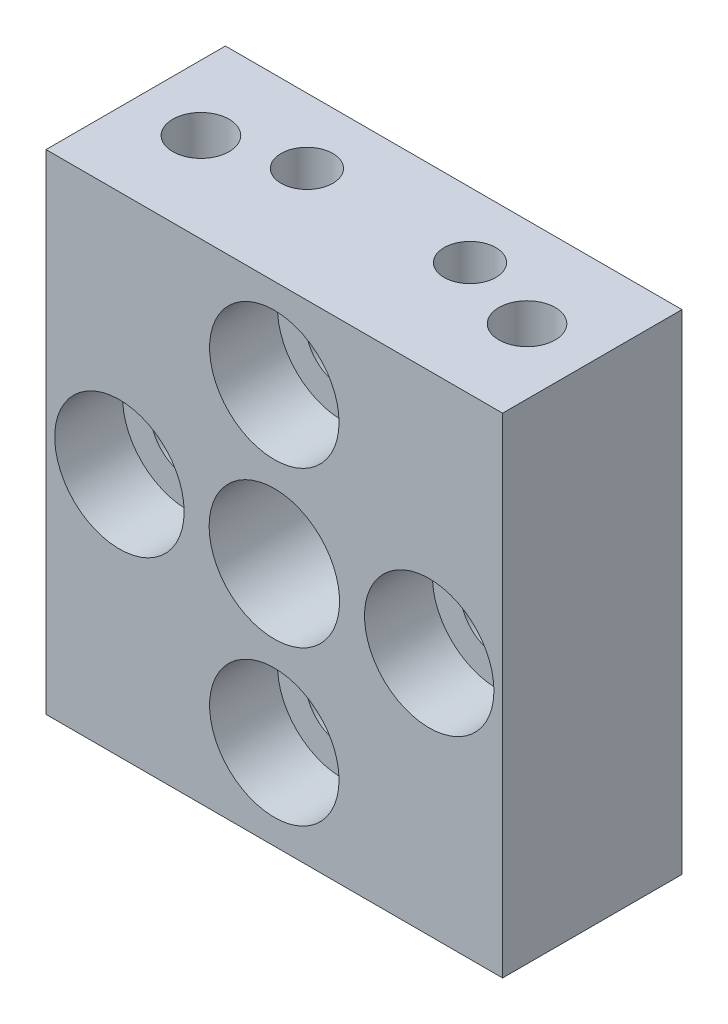
ISO-10303-21;
HEADER;
FILE_DESCRIPTION(('STEP AP214'),'2;1');
FILE_NAME('part.step','',(''),(''),'','','');
FILE_SCHEMA(('AUTOMOTIVE_DESIGN { 1 0 10303 214 1 1 1 1 }'));
ENDSEC;
DATA;
#1=APPLICATION_CONTEXT('core data for automotive mechanical design processes');
#2=APPLICATION_PROTOCOL_DEFINITION('international standard','automotive_design',2000,#1);
#3=PRODUCT_CONTEXT('',#1,'mechanical');
#4=PRODUCT('Part','Part','',(#3));
#5=PRODUCT_RELATED_PRODUCT_CATEGORY('part','',(#4));
#6=PRODUCT_DEFINITION_FORMATION('','',#4);
#7=PRODUCT_DEFINITION_CONTEXT('part definition',#1,'design');
#8=PRODUCT_DEFINITION('design','',#6,#7);
#9=PRODUCT_DEFINITION_SHAPE('','',#8);
#10=(LENGTH_UNIT() NAMED_UNIT(*) SI_UNIT(.MILLI.,.METRE.));
#11=(NAMED_UNIT(*) PLANE_ANGLE_UNIT() SI_UNIT($,.RADIAN.));
#12=(NAMED_UNIT(*) SI_UNIT($,.STERADIAN.) SOLID_ANGLE_UNIT());
#13=UNCERTAINTY_MEASURE_WITH_UNIT(LENGTH_MEASURE(1.E-05),#10,'distance_accuracy_value','');
#14=(GEOMETRIC_REPRESENTATION_CONTEXT(3) GLOBAL_UNCERTAINTY_ASSIGNED_CONTEXT((#13)) GLOBAL_UNIT_ASSIGNED_CONTEXT((#10,
#11,#12)) REPRESENTATION_CONTEXT('',''));
#15=CARTESIAN_POINT('',(0.,0.,0.));
#16=DIRECTION('',(0.,0.,1.));
#17=DIRECTION('',(1.,0.,0.));
#18=AXIS2_PLACEMENT_3D('',#15,#16,#17);
#19=CARTESIAN_POINT('',(0.,-15.,11.));
#20=DIRECTION('',(1.,0.,0.));
#21=DIRECTION('',(0.,0.,-1.));
#22=AXIS2_PLACEMENT_3D('',#19,#20,#21);
#23=PLANE('',#22);
#24=DIRECTION('',(0.,-1.,0.));
#25=VECTOR('',#24,1.);
#26=CARTESIAN_POINT('',(0.,-15.,0.));
#27=LINE('',#26,#25);
#28=CARTESIAN_POINT('',(0.,15.,0.));
#29=VERTEX_POINT('',#28);
#30=CARTESIAN_POINT('',(0.,-15.,0.));
#31=VERTEX_POINT('',#30);
#32=EDGE_CURVE('E231',#29,#31,#27,.T.);
#33=ORIENTED_EDGE('',*,*,#32,.T.);
#34=DIRECTION('',(0.,0.,-1.));
#35=VECTOR('',#34,1.);
#36=CARTESIAN_POINT('',(0.,-15.,11.));
#37=LINE('',#36,#35);
#38=CARTESIAN_POINT('',(0.,-15.,11.));
#39=VERTEX_POINT('',#38);
#40=EDGE_CURVE('E11',#39,#31,#37,.T.);
#41=ORIENTED_EDGE('',*,*,#40,.F.);
#42=DIRECTION('',(0.,-1.,0.));
#43=VECTOR('',#42,1.);
#44=CARTESIAN_POINT('',(0.,-15.,11.));
#45=LINE('',#44,#43);
#46=CARTESIAN_POINT('',(0.,15.,11.));
#47=VERTEX_POINT('',#46);
#48=EDGE_CURVE('E232',#47,#39,#45,.T.);
#49=ORIENTED_EDGE('',*,*,#48,.F.);
#50=DIRECTION('',(0.,0.,-1.));
#51=VECTOR('',#50,1.);
#52=CARTESIAN_POINT('',(0.,15.,11.));
#53=LINE('',#52,#51);
#54=EDGE_CURVE('E238',#47,#29,#53,.T.);
#55=ORIENTED_EDGE('',*,*,#54,.T.);
#56=EDGE_LOOP('',(#33,#41,#49,#55));
#57=FACE_BOUND('',#56,.T.);
#58=ADVANCED_FACE('F36',(#57),#23,.F.);
#59=CARTESIAN_POINT('',(0.,-15.,11.));
#60=DIRECTION('',(0.,1.,0.));
#61=DIRECTION('',(0.,0.,1.));
#62=AXIS2_PLACEMENT_3D('',#59,#60,#61);
#63=PLANE('',#62);
#64=CARTESIAN_POINT('',(9.,-15.,4.));
#65=DIRECTION('',(0.,-1.,0.));
#66=DIRECTION('',(0.,0.,-1.));
#67=AXIS2_PLACEMENT_3D('',#64,#65,#66);
#68=CIRCLE('',#67,1.5875);
#69=CARTESIAN_POINT('',(9.,-15.,2.4125));
#70=VERTEX_POINT('',#69);
#71=EDGE_CURVE('E119',#70,#70,#68,.T.);
#72=ORIENTED_EDGE('',*,*,#71,.F.);
#73=EDGE_LOOP('',(#72));
#74=FACE_BOUND('',#73,.T.);
#75=CARTESIAN_POINT('',(19.,-15.,4.));
#76=DIRECTION('',(0.,-1.,0.));
#77=DIRECTION('',(0.,0.,-1.));
#78=AXIS2_PLACEMENT_3D('',#75,#76,#77);
#79=CIRCLE('',#78,1.5875);
#80=CARTESIAN_POINT('',(19.,-15.,2.4125));
#81=VERTEX_POINT('',#80);
#82=EDGE_CURVE('E118',#81,#81,#79,.T.);
#83=ORIENTED_EDGE('',*,*,#82,.F.);
#84=EDGE_LOOP('',(#83));
#85=FACE_BOUND('',#84,.T.);
#86=CARTESIAN_POINT('',(4.,-15.,5.5));
#87=DIRECTION('',(0.,-1.,0.));
#88=DIRECTION('',(0.,0.,-1.));
#89=AXIS2_PLACEMENT_3D('',#86,#87,#88);
#90=CIRCLE('',#89,1.7272);
#91=CARTESIAN_POINT('',(4.,-15.,3.7728));
#92=VERTEX_POINT('',#91);
#93=EDGE_CURVE('E129',#92,#92,#90,.T.);
#94=ORIENTED_EDGE('',*,*,#93,.F.);
#95=EDGE_LOOP('',(#94));
#96=FACE_BOUND('',#95,.T.);
#97=CARTESIAN_POINT('',(24.,-15.,5.5));
#98=DIRECTION('',(0.,-1.,0.));
#99=DIRECTION('',(0.,0.,-1.));
#100=AXIS2_PLACEMENT_3D('',#97,#98,#99);
#101=CIRCLE('',#100,1.7272);
#102=CARTESIAN_POINT('',(24.,-15.,3.7728));
#103=VERTEX_POINT('',#102);
#104=EDGE_CURVE('E135',#103,#103,#101,.T.);
#105=ORIENTED_EDGE('',*,*,#104,.F.);
#106=EDGE_LOOP('',(#105));
#107=FACE_BOUND('',#106,.T.);
#108=DIRECTION('',(1.,0.,0.));
#109=VECTOR('',#108,1.);
#110=CARTESIAN_POINT('',(0.,-15.,0.));
#111=LINE('',#110,#109);
#112=CARTESIAN_POINT('',(28.,-15.,0.));
#113=VERTEX_POINT('',#112);
#114=EDGE_CURVE('E241',#31,#113,#111,.T.);
#115=ORIENTED_EDGE('',*,*,#114,.T.);
#116=DIRECTION('',(0.,0.,-1.));
#117=VECTOR('',#116,1.);
#118=CARTESIAN_POINT('',(28.,-15.,11.));
#119=LINE('',#118,#117);
#120=CARTESIAN_POINT('',(28.,-15.,11.));
#121=VERTEX_POINT('',#120);
#122=EDGE_CURVE('E44',#121,#113,#119,.T.);
#123=ORIENTED_EDGE('',*,*,#122,.F.);
#124=DIRECTION('',(1.,0.,0.));
#125=VECTOR('',#124,1.);
#126=CARTESIAN_POINT('',(0.,-15.,11.));
#127=LINE('',#126,#125);
#128=EDGE_CURVE('E83',#39,#121,#127,.T.);
#129=ORIENTED_EDGE('',*,*,#128,.F.);
#130=ORIENTED_EDGE('',*,*,#40,.T.);
#131=EDGE_LOOP('',(#115,#123,#129,#130));
#132=FACE_BOUND('',#131,.T.);
#133=ADVANCED_FACE('F266',(#74,#85,#96,#107,#132),#63,.F.);
#134=CARTESIAN_POINT('',(28.,-15.,11.));
#135=DIRECTION('',(-1.,0.,0.));
#136=DIRECTION('',(0.,0.,1.));
#137=AXIS2_PLACEMENT_3D('',#134,#135,#136);
#138=PLANE('',#137);
#139=DIRECTION('',(0.,1.,0.));
#140=VECTOR('',#139,1.);
#141=CARTESIAN_POINT('',(28.,-15.,0.));
#142=LINE('',#141,#140);
#143=CARTESIAN_POINT('',(28.,15.,0.));
#144=VERTEX_POINT('',#143);
#145=EDGE_CURVE('E70',#113,#144,#142,.T.);
#146=ORIENTED_EDGE('',*,*,#145,.T.);
#147=DIRECTION('',(0.,0.,-1.));
#148=VECTOR('',#147,1.);
#149=CARTESIAN_POINT('',(28.,15.,11.));
#150=LINE('',#149,#148);
#151=CARTESIAN_POINT('',(28.,15.,11.));
#152=VERTEX_POINT('',#151);
#153=EDGE_CURVE('E246',#152,#144,#150,.T.);
#154=ORIENTED_EDGE('',*,*,#153,.F.);
#155=DIRECTION('',(0.,1.,0.));
#156=VECTOR('',#155,1.);
#157=CARTESIAN_POINT('',(28.,-15.,11.));
#158=LINE('',#157,#156);
#159=EDGE_CURVE('E235',#121,#152,#158,.T.);
#160=ORIENTED_EDGE('',*,*,#159,.F.);
#161=ORIENTED_EDGE('',*,*,#122,.T.);
#162=EDGE_LOOP('',(#146,#154,#160,#161));
#163=FACE_BOUND('',#162,.T.);
#164=ADVANCED_FACE('F248',(#163),#138,.F.);
#165=CARTESIAN_POINT('',(0.,15.,11.));
#166=DIRECTION('',(0.,-1.,0.));
#167=DIRECTION('',(0.,0.,-1.));
#168=AXIS2_PLACEMENT_3D('',#165,#166,#167);
#169=PLANE('',#168);
#170=CARTESIAN_POINT('',(9.,15.,4.));
#171=DIRECTION('',(0.,1.,0.));
#172=DIRECTION('',(0.,0.,1.));
#173=AXIS2_PLACEMENT_3D('',#170,#171,#172);
#174=CIRCLE('',#173,1.5875);
#175=CARTESIAN_POINT('',(9.,15.,5.5875));
#176=VERTEX_POINT('',#175);
#177=EDGE_CURVE('E141',#176,#176,#174,.T.);
#178=ORIENTED_EDGE('',*,*,#177,.F.);
#179=EDGE_LOOP('',(#178));
#180=FACE_BOUND('',#179,.T.);
#181=CARTESIAN_POINT('',(19.,15.,4.));
#182=DIRECTION('',(0.,1.,0.));
#183=DIRECTION('',(0.,0.,1.));
#184=AXIS2_PLACEMENT_3D('',#181,#182,#183);
#185=CIRCLE('',#184,1.5875);
#186=CARTESIAN_POINT('',(19.,15.,5.5875));
#187=VERTEX_POINT('',#186);
#188=EDGE_CURVE('E147',#187,#187,#185,.T.);
#189=ORIENTED_EDGE('',*,*,#188,.F.);
#190=EDGE_LOOP('',(#189));
#191=FACE_BOUND('',#190,.T.);
#192=CARTESIAN_POINT('',(4.,15.,5.5));
#193=DIRECTION('',(0.,1.,0.));
#194=DIRECTION('',(0.,0.,1.));
#195=AXIS2_PLACEMENT_3D('',#192,#193,#194);
#196=CIRCLE('',#195,1.7272);
#197=CARTESIAN_POINT('',(4.,15.,7.2272));
#198=VERTEX_POINT('',#197);
#199=EDGE_CURVE('E153',#198,#198,#196,.T.);
#200=ORIENTED_EDGE('',*,*,#199,.F.);
#201=EDGE_LOOP('',(#200));
#202=FACE_BOUND('',#201,.T.);
#203=CARTESIAN_POINT('',(24.,15.,5.5));
#204=DIRECTION('',(0.,1.,0.));
#205=DIRECTION('',(0.,0.,1.));
#206=AXIS2_PLACEMENT_3D('',#203,#204,#205);
#207=CIRCLE('',#206,1.7272);
#208=CARTESIAN_POINT('',(24.,15.,7.2272));
#209=VERTEX_POINT('',#208);
#210=EDGE_CURVE('E159',#209,#209,#207,.T.);
#211=ORIENTED_EDGE('',*,*,#210,.F.);
#212=EDGE_LOOP('',(#211));
#213=FACE_BOUND('',#212,.T.);
#214=DIRECTION('',(-1.,0.,0.));
#215=VECTOR('',#214,1.);
#216=CARTESIAN_POINT('',(0.,15.,0.));
#217=LINE('',#216,#215);
#218=EDGE_CURVE('E76',#144,#29,#217,.T.);
#219=ORIENTED_EDGE('',*,*,#218,.T.);
#220=ORIENTED_EDGE('',*,*,#54,.F.);
#221=DIRECTION('',(-1.,0.,0.));
#222=VECTOR('',#221,1.);
#223=CARTESIAN_POINT('',(0.,15.,11.));
#224=LINE('',#223,#222);
#225=EDGE_CURVE('E52',#152,#47,#224,.T.);
#226=ORIENTED_EDGE('',*,*,#225,.F.);
#227=ORIENTED_EDGE('',*,*,#153,.T.);
#228=EDGE_LOOP('',(#219,#220,#226,#227));
#229=FACE_BOUND('',#228,.T.);
#230=ADVANCED_FACE('F255',(#180,#191,#202,#213,#229),#169,.F.);
#231=CARTESIAN_POINT('',(0.,0.,11.));
#232=DIRECTION('',(0.,0.,-1.));
#233=DIRECTION('',(-1.,0.,0.));
#234=AXIS2_PLACEMENT_3D('',#231,#232,#233);
#235=PLANE('',#234);
#236=CARTESIAN_POINT('',(4.5,0.,11.));
#237=DIRECTION('',(0.,0.,1.));
#238=DIRECTION('',(1.,0.,0.));
#239=AXIS2_PLACEMENT_3D('',#236,#237,#238);
#240=CIRCLE('',#239,3.96875);
#241=CARTESIAN_POINT('',(8.46875,0.,11.));
#242=VERTEX_POINT('',#241);
#243=EDGE_CURVE('E165',#242,#242,#240,.T.);
#244=ORIENTED_EDGE('',*,*,#243,.F.);
#245=EDGE_LOOP('',(#244));
#246=FACE_BOUND('',#245,.T.);
#247=CARTESIAN_POINT('',(14.,9.5,11.));
#248=DIRECTION('',(0.,0.,1.));
#249=DIRECTION('',(1.,0.,0.));
#250=AXIS2_PLACEMENT_3D('',#247,#248,#249);
#251=CIRCLE('',#250,3.96875);
#252=CARTESIAN_POINT('',(17.96875,9.5,11.));
#253=VERTEX_POINT('',#252);
#254=EDGE_CURVE('E177',#253,#253,#251,.T.);
#255=ORIENTED_EDGE('',*,*,#254,.F.);
#256=EDGE_LOOP('',(#255));
#257=FACE_BOUND('',#256,.T.);
#258=CARTESIAN_POINT('',(14.,-9.5,11.));
#259=DIRECTION('',(0.,0.,1.));
#260=DIRECTION('',(1.,0.,0.));
#261=AXIS2_PLACEMENT_3D('',#258,#259,#260);
#262=CIRCLE('',#261,3.96875);
#263=CARTESIAN_POINT('',(17.96875,-9.5,11.));
#264=VERTEX_POINT('',#263);
#265=EDGE_CURVE('E189',#264,#264,#262,.T.);
#266=ORIENTED_EDGE('',*,*,#265,.F.);
#267=EDGE_LOOP('',(#266));
#268=FACE_BOUND('',#267,.T.);
#269=CARTESIAN_POINT('',(23.5,0.,11.));
#270=DIRECTION('',(0.,0.,1.));
#271=DIRECTION('',(1.,0.,0.));
#272=AXIS2_PLACEMENT_3D('',#269,#270,#271);
#273=CIRCLE('',#272,3.96875);
#274=CARTESIAN_POINT('',(27.46875,0.,11.));
#275=VERTEX_POINT('',#274);
#276=EDGE_CURVE('E201',#275,#275,#273,.T.);
#277=ORIENTED_EDGE('',*,*,#276,.F.);
#278=EDGE_LOOP('',(#277));
#279=FACE_BOUND('',#278,.T.);
#280=CARTESIAN_POINT('',(14.,0.,11.));
#281=DIRECTION('',(0.,0.,-1.));
#282=DIRECTION('',(-1.,0.,0.));
#283=AXIS2_PLACEMENT_3D('',#280,#281,#282);
#284=CIRCLE('',#283,4.);
#285=CARTESIAN_POINT('',(10.,0.,11.));
#286=VERTEX_POINT('',#285);
#287=EDGE_CURVE('E228',#286,#286,#284,.T.);
#288=ORIENTED_EDGE('',*,*,#287,.T.);
#289=EDGE_LOOP('',(#288));
#290=FACE_BOUND('',#289,.T.);
#291=ORIENTED_EDGE('',*,*,#48,.T.);
#292=ORIENTED_EDGE('',*,*,#128,.T.);
#293=ORIENTED_EDGE('',*,*,#159,.T.);
#294=ORIENTED_EDGE('',*,*,#225,.T.);
#295=EDGE_LOOP('',(#291,#292,#293,#294));
#296=FACE_BOUND('',#295,.T.);
#297=ADVANCED_FACE('F257',(#246,#257,#268,#279,#290,#296),#235,.F.);
#298=CARTESIAN_POINT('',(0.,0.,0.));
#299=DIRECTION('',(0.,0.,-1.));
#300=DIRECTION('',(-1.,0.,0.));
#301=AXIS2_PLACEMENT_3D('',#298,#299,#300);
#302=PLANE('',#301);
#303=CARTESIAN_POINT('',(4.5,0.,0.));
#304=DIRECTION('',(0.,0.,-1.));
#305=DIRECTION('',(-1.,0.,0.));
#306=AXIS2_PLACEMENT_3D('',#303,#304,#305);
#307=CIRCLE('',#306,2.2479);
#308=CARTESIAN_POINT('',(2.2521,0.,0.));
#309=VERTEX_POINT('',#308);
#310=EDGE_CURVE('E174',#309,#309,#307,.T.);
#311=ORIENTED_EDGE('',*,*,#310,.F.);
#312=EDGE_LOOP('',(#311));
#313=FACE_BOUND('',#312,.T.);
#314=CARTESIAN_POINT('',(14.,9.5,0.));
#315=DIRECTION('',(0.,0.,-1.));
#316=DIRECTION('',(-1.,0.,0.));
#317=AXIS2_PLACEMENT_3D('',#314,#315,#316);
#318=CIRCLE('',#317,2.2479);
#319=CARTESIAN_POINT('',(11.7521,9.5,0.));
#320=VERTEX_POINT('',#319);
#321=EDGE_CURVE('E186',#320,#320,#318,.T.);
#322=ORIENTED_EDGE('',*,*,#321,.F.);
#323=EDGE_LOOP('',(#322));
#324=FACE_BOUND('',#323,.T.);
#325=CARTESIAN_POINT('',(14.,-9.5,0.));
#326=DIRECTION('',(0.,0.,-1.));
#327=DIRECTION('',(-1.,0.,0.));
#328=AXIS2_PLACEMENT_3D('',#325,#326,#327);
#329=CIRCLE('',#328,2.2479);
#330=CARTESIAN_POINT('',(11.7521,-9.5,0.));
#331=VERTEX_POINT('',#330);
#332=EDGE_CURVE('E198',#331,#331,#329,.T.);
#333=ORIENTED_EDGE('',*,*,#332,.F.);
#334=EDGE_LOOP('',(#333));
#335=FACE_BOUND('',#334,.T.);
#336=CARTESIAN_POINT('',(23.5,0.,0.));
#337=DIRECTION('',(0.,0.,-1.));
#338=DIRECTION('',(-1.,0.,0.));
#339=AXIS2_PLACEMENT_3D('',#336,#337,#338);
#340=CIRCLE('',#339,2.2479);
#341=CARTESIAN_POINT('',(21.2521,0.,0.));
#342=VERTEX_POINT('',#341);
#343=EDGE_CURVE('E210',#342,#342,#340,.T.);
#344=ORIENTED_EDGE('',*,*,#343,.F.);
#345=EDGE_LOOP('',(#344));
#346=FACE_BOUND('',#345,.T.);
#347=CARTESIAN_POINT('',(14.,0.,0.));
#348=DIRECTION('',(0.,0.,-1.));
#349=DIRECTION('',(-1.,0.,0.));
#350=AXIS2_PLACEMENT_3D('',#347,#348,#349);
#351=CIRCLE('',#350,6.5);
#352=CARTESIAN_POINT('',(7.5,0.,0.));
#353=VERTEX_POINT('',#352);
#354=EDGE_CURVE('E213',#353,#353,#351,.T.);
#355=ORIENTED_EDGE('',*,*,#354,.F.);
#356=EDGE_LOOP('',(#355));
#357=FACE_BOUND('',#356,.T.);
#358=ORIENTED_EDGE('',*,*,#32,.F.);
#359=ORIENTED_EDGE('',*,*,#218,.F.);
#360=ORIENTED_EDGE('',*,*,#145,.F.);
#361=ORIENTED_EDGE('',*,*,#114,.F.);
#362=EDGE_LOOP('',(#358,#359,#360,#361));
#363=FACE_BOUND('',#362,.T.);
#364=ADVANCED_FACE('F251',(#313,#324,#335,#346,#357,#363),#302,.T.);
#365=CARTESIAN_POINT('',(14.,0.,0.));
#366=DIRECTION('',(0.,0.,-1.));
#367=DIRECTION('',(-1.,0.,0.));
#368=AXIS2_PLACEMENT_3D('',#365,#366,#367);
#369=CYLINDRICAL_SURFACE('',#368,4.);
#370=ORIENTED_EDGE('',*,*,#287,.F.);
#371=EDGE_LOOP('',(#370));
#372=FACE_BOUND('',#371,.T.);
#373=CARTESIAN_POINT('',(14.,0.,3.25000000000001));
#374=DIRECTION('',(0.,0.,-1.));
#375=DIRECTION('',(-1.,0.,0.));
#376=AXIS2_PLACEMENT_3D('',#373,#374,#375);
#377=CIRCLE('',#376,4.);
#378=CARTESIAN_POINT('',(10.,0.,3.25000000000001));
#379=VERTEX_POINT('',#378);
#380=EDGE_CURVE('E225',#379,#379,#377,.T.);
#381=ORIENTED_EDGE('',*,*,#380,.T.);
#382=EDGE_LOOP('',(#381));
#383=FACE_BOUND('',#382,.T.);
#384=ADVANCED_FACE('F399',(#372,#383),#369,.F.);
#385=CARTESIAN_POINT('',(14.,0.,3.));
#386=DIRECTION('',(0.,0.,-1.));
#387=DIRECTION('',(-1.,0.,0.));
#388=AXIS2_PLACEMENT_3D('',#385,#386,#387);
#389=CONICAL_SURFACE('',#388,4.25,0.785398163397436);
#390=ORIENTED_EDGE('',*,*,#380,.F.);
#391=EDGE_LOOP('',(#390));
#392=FACE_BOUND('',#391,.T.);
#393=CARTESIAN_POINT('',(14.,0.,3.));
#394=DIRECTION('',(0.,0.,-1.));
#395=DIRECTION('',(-1.,0.,0.));
#396=AXIS2_PLACEMENT_3D('',#393,#394,#395);
#397=CIRCLE('',#396,4.25);
#398=CARTESIAN_POINT('',(9.75,0.,3.));
#399=VERTEX_POINT('',#398);
#400=EDGE_CURVE('E222',#399,#399,#397,.T.);
#401=ORIENTED_EDGE('',*,*,#400,.T.);
#402=EDGE_LOOP('',(#401));
#403=FACE_BOUND('',#402,.T.);
#404=ADVANCED_FACE('F395',(#392,#403),#389,.F.);
#405=CARTESIAN_POINT('',(18.25,0.,3.));
#406=DIRECTION('',(0.,0.,1.));
#407=DIRECTION('',(1.,0.,0.));
#408=AXIS2_PLACEMENT_3D('',#405,#406,#407);
#409=PLANE('',#408);
#410=ORIENTED_EDGE('',*,*,#400,.F.);
#411=EDGE_LOOP('',(#410));
#412=FACE_BOUND('',#411,.T.);
#413=CARTESIAN_POINT('',(14.,0.,3.));
#414=DIRECTION('',(0.,0.,-1.));
#415=DIRECTION('',(-1.,0.,0.));
#416=AXIS2_PLACEMENT_3D('',#413,#414,#415);
#417=CIRCLE('',#416,5.49999999999999);
#418=CARTESIAN_POINT('',(8.50000000000001,0.,3.));
#419=VERTEX_POINT('',#418);
#420=EDGE_CURVE('E219',#419,#419,#417,.T.);
#421=ORIENTED_EDGE('',*,*,#420,.T.);
#422=EDGE_LOOP('',(#421));
#423=FACE_BOUND('',#422,.T.);
#424=ADVANCED_FACE('F391',(#412,#423),#409,.F.);
#425=CARTESIAN_POINT('',(14.,0.,0.));
#426=DIRECTION('',(0.,0.,-1.));
#427=DIRECTION('',(-1.,0.,0.));
#428=AXIS2_PLACEMENT_3D('',#425,#426,#427);
#429=CYLINDRICAL_SURFACE('',#428,5.5);
#430=ORIENTED_EDGE('',*,*,#420,.F.);
#431=EDGE_LOOP('',(#430));
#432=FACE_BOUND('',#431,.T.);
#433=CARTESIAN_POINT('',(14.,0.,1.));
#434=DIRECTION('',(0.,0.,-1.));
#435=DIRECTION('',(-1.,0.,0.));
#436=AXIS2_PLACEMENT_3D('',#433,#434,#435);
#437=CIRCLE('',#436,5.5);
#438=CARTESIAN_POINT('',(8.5,0.,1.));
#439=VERTEX_POINT('',#438);
#440=EDGE_CURVE('E216',#439,#439,#437,.T.);
#441=ORIENTED_EDGE('',*,*,#440,.T.);
#442=EDGE_LOOP('',(#441));
#443=FACE_BOUND('',#442,.T.);
#444=ADVANCED_FACE('F387',(#432,#443),#429,.F.);
#445=CARTESIAN_POINT('',(14.,0.,0.));
#446=DIRECTION('',(0.,0.,-1.));
#447=DIRECTION('',(-1.,0.,0.));
#448=AXIS2_PLACEMENT_3D('',#445,#446,#447);
#449=CONICAL_SURFACE('',#448,6.5,0.785398163397449);
#450=ORIENTED_EDGE('',*,*,#440,.F.);
#451=EDGE_LOOP('',(#450));
#452=FACE_BOUND('',#451,.T.);
#453=ORIENTED_EDGE('',*,*,#354,.T.);
#454=EDGE_LOOP('',(#453));
#455=FACE_BOUND('',#454,.T.);
#456=ADVANCED_FACE('F383',(#452,#455),#449,.F.);
#457=CARTESIAN_POINT('',(23.5,0.,11.));
#458=DIRECTION('',(0.,0.,1.));
#459=DIRECTION('',(1.,0.,0.));
#460=AXIS2_PLACEMENT_3D('',#457,#458,#459);
#461=CYLINDRICAL_SURFACE('',#460,2.2479);
#462=CARTESIAN_POINT('',(23.5,0.,6.8344));
#463=DIRECTION('',(0.,0.,1.));
#464=DIRECTION('',(1.,0.,0.));
#465=AXIS2_PLACEMENT_3D('',#462,#463,#464);
#466=CIRCLE('',#465,2.2479);
#467=CARTESIAN_POINT('',(25.7479,0.,6.8344));
#468=VERTEX_POINT('',#467);
#469=EDGE_CURVE('E207',#468,#468,#466,.T.);
#470=ORIENTED_EDGE('',*,*,#469,.T.);
#471=EDGE_LOOP('',(#470));
#472=FACE_BOUND('',#471,.T.);
#473=ORIENTED_EDGE('',*,*,#343,.T.);
#474=EDGE_LOOP('',(#473));
#475=FACE_BOUND('',#474,.T.);
#476=ADVANCED_FACE('F379',(#472,#475),#461,.F.);
#477=CARTESIAN_POINT('',(25.7479,0.,6.8344));
#478=DIRECTION('',(0.,0.,-1.));
#479=DIRECTION('',(-1.,0.,0.));
#480=AXIS2_PLACEMENT_3D('',#477,#478,#479);
#481=PLANE('',#480);
#482=ORIENTED_EDGE('',*,*,#469,.F.);
#483=EDGE_LOOP('',(#482));
#484=FACE_BOUND('',#483,.T.);
#485=CARTESIAN_POINT('',(23.5,0.,6.8344));
#486=DIRECTION('',(0.,0.,1.));
#487=DIRECTION('',(1.,0.,0.));
#488=AXIS2_PLACEMENT_3D('',#485,#486,#487);
#489=CIRCLE('',#488,3.96875);
#490=CARTESIAN_POINT('',(27.46875,0.,6.8344));
#491=VERTEX_POINT('',#490);
#492=EDGE_CURVE('E204',#491,#491,#489,.T.);
#493=ORIENTED_EDGE('',*,*,#492,.T.);
#494=EDGE_LOOP('',(#493));
#495=FACE_BOUND('',#494,.T.);
#496=ADVANCED_FACE('F375',(#484,#495),#481,.F.);
#497=CARTESIAN_POINT('',(23.5,0.,11.));
#498=DIRECTION('',(0.,0.,1.));
#499=DIRECTION('',(1.,0.,0.));
#500=AXIS2_PLACEMENT_3D('',#497,#498,#499);
#501=CYLINDRICAL_SURFACE('',#500,3.96875);
#502=ORIENTED_EDGE('',*,*,#492,.F.);
#503=EDGE_LOOP('',(#502));
#504=FACE_BOUND('',#503,.T.);
#505=ORIENTED_EDGE('',*,*,#276,.T.);
#506=EDGE_LOOP('',(#505));
#507=FACE_BOUND('',#506,.T.);
#508=ADVANCED_FACE('F371',(#504,#507),#501,.F.);
#509=CARTESIAN_POINT('',(14.,-9.5,11.));
#510=DIRECTION('',(0.,0.,1.));
#511=DIRECTION('',(1.,0.,0.));
#512=AXIS2_PLACEMENT_3D('',#509,#510,#511);
#513=CYLINDRICAL_SURFACE('',#512,2.2479);
#514=CARTESIAN_POINT('',(14.,-9.5,6.8344));
#515=DIRECTION('',(0.,0.,1.));
#516=DIRECTION('',(1.,0.,0.));
#517=AXIS2_PLACEMENT_3D('',#514,#515,#516);
#518=CIRCLE('',#517,2.2479);
#519=CARTESIAN_POINT('',(16.2479,-9.5,6.8344));
#520=VERTEX_POINT('',#519);
#521=EDGE_CURVE('E195',#520,#520,#518,.T.);
#522=ORIENTED_EDGE('',*,*,#521,.T.);
#523=EDGE_LOOP('',(#522));
#524=FACE_BOUND('',#523,.T.);
#525=ORIENTED_EDGE('',*,*,#332,.T.);
#526=EDGE_LOOP('',(#525));
#527=FACE_BOUND('',#526,.T.);
#528=ADVANCED_FACE('F367',(#524,#527),#513,.F.);
#529=CARTESIAN_POINT('',(16.2479,-9.5,6.8344));
#530=DIRECTION('',(0.,0.,-1.));
#531=DIRECTION('',(-1.,0.,0.));
#532=AXIS2_PLACEMENT_3D('',#529,#530,#531);
#533=PLANE('',#532);
#534=ORIENTED_EDGE('',*,*,#521,.F.);
#535=EDGE_LOOP('',(#534));
#536=FACE_BOUND('',#535,.T.);
#537=CARTESIAN_POINT('',(14.,-9.5,6.8344));
#538=DIRECTION('',(0.,0.,1.));
#539=DIRECTION('',(1.,0.,0.));
#540=AXIS2_PLACEMENT_3D('',#537,#538,#539);
#541=CIRCLE('',#540,3.96875);
#542=CARTESIAN_POINT('',(17.96875,-9.5,6.8344));
#543=VERTEX_POINT('',#542);
#544=EDGE_CURVE('E192',#543,#543,#541,.T.);
#545=ORIENTED_EDGE('',*,*,#544,.T.);
#546=EDGE_LOOP('',(#545));
#547=FACE_BOUND('',#546,.T.);
#548=ADVANCED_FACE('F363',(#536,#547),#533,.F.);
#549=CARTESIAN_POINT('',(14.,-9.5,11.));
#550=DIRECTION('',(0.,0.,1.));
#551=DIRECTION('',(1.,0.,0.));
#552=AXIS2_PLACEMENT_3D('',#549,#550,#551);
#553=CYLINDRICAL_SURFACE('',#552,3.96875);
#554=ORIENTED_EDGE('',*,*,#544,.F.);
#555=EDGE_LOOP('',(#554));
#556=FACE_BOUND('',#555,.T.);
#557=ORIENTED_EDGE('',*,*,#265,.T.);
#558=EDGE_LOOP('',(#557));
#559=FACE_BOUND('',#558,.T.);
#560=ADVANCED_FACE('F359',(#556,#559),#553,.F.);
#561=CARTESIAN_POINT('',(14.,9.5,11.));
#562=DIRECTION('',(0.,0.,1.));
#563=DIRECTION('',(1.,0.,0.));
#564=AXIS2_PLACEMENT_3D('',#561,#562,#563);
#565=CYLINDRICAL_SURFACE('',#564,2.2479);
#566=CARTESIAN_POINT('',(14.,9.5,6.8344));
#567=DIRECTION('',(0.,0.,1.));
#568=DIRECTION('',(1.,0.,0.));
#569=AXIS2_PLACEMENT_3D('',#566,#567,#568);
#570=CIRCLE('',#569,2.2479);
#571=CARTESIAN_POINT('',(16.2479,9.5,6.8344));
#572=VERTEX_POINT('',#571);
#573=EDGE_CURVE('E183',#572,#572,#570,.T.);
#574=ORIENTED_EDGE('',*,*,#573,.T.);
#575=EDGE_LOOP('',(#574));
#576=FACE_BOUND('',#575,.T.);
#577=ORIENTED_EDGE('',*,*,#321,.T.);
#578=EDGE_LOOP('',(#577));
#579=FACE_BOUND('',#578,.T.);
#580=ADVANCED_FACE('F355',(#576,#579),#565,.F.);
#581=CARTESIAN_POINT('',(16.2479,9.5,6.8344));
#582=DIRECTION('',(0.,0.,-1.));
#583=DIRECTION('',(-1.,0.,0.));
#584=AXIS2_PLACEMENT_3D('',#581,#582,#583);
#585=PLANE('',#584);
#586=ORIENTED_EDGE('',*,*,#573,.F.);
#587=EDGE_LOOP('',(#586));
#588=FACE_BOUND('',#587,.T.);
#589=CARTESIAN_POINT('',(14.,9.5,6.8344));
#590=DIRECTION('',(0.,0.,1.));
#591=DIRECTION('',(1.,0.,0.));
#592=AXIS2_PLACEMENT_3D('',#589,#590,#591);
#593=CIRCLE('',#592,3.96875);
#594=CARTESIAN_POINT('',(17.96875,9.5,6.8344));
#595=VERTEX_POINT('',#594);
#596=EDGE_CURVE('E180',#595,#595,#593,.T.);
#597=ORIENTED_EDGE('',*,*,#596,.T.);
#598=EDGE_LOOP('',(#597));
#599=FACE_BOUND('',#598,.T.);
#600=ADVANCED_FACE('F351',(#588,#599),#585,.F.);
#601=CARTESIAN_POINT('',(14.,9.5,11.));
#602=DIRECTION('',(0.,0.,1.));
#603=DIRECTION('',(1.,0.,0.));
#604=AXIS2_PLACEMENT_3D('',#601,#602,#603);
#605=CYLINDRICAL_SURFACE('',#604,3.96875);
#606=ORIENTED_EDGE('',*,*,#596,.F.);
#607=EDGE_LOOP('',(#606));
#608=FACE_BOUND('',#607,.T.);
#609=ORIENTED_EDGE('',*,*,#254,.T.);
#610=EDGE_LOOP('',(#609));
#611=FACE_BOUND('',#610,.T.);
#612=ADVANCED_FACE('F347',(#608,#611),#605,.F.);
#613=CARTESIAN_POINT('',(4.5,0.,11.));
#614=DIRECTION('',(0.,0.,1.));
#615=DIRECTION('',(1.,0.,0.));
#616=AXIS2_PLACEMENT_3D('',#613,#614,#615);
#617=CYLINDRICAL_SURFACE('',#616,2.2479);
#618=CARTESIAN_POINT('',(4.5,0.,6.8344));
#619=DIRECTION('',(0.,0.,1.));
#620=DIRECTION('',(1.,0.,0.));
#621=AXIS2_PLACEMENT_3D('',#618,#619,#620);
#622=CIRCLE('',#621,2.2479);
#623=CARTESIAN_POINT('',(6.7479,0.,6.8344));
#624=VERTEX_POINT('',#623);
#625=EDGE_CURVE('E171',#624,#624,#622,.T.);
#626=ORIENTED_EDGE('',*,*,#625,.T.);
#627=EDGE_LOOP('',(#626));
#628=FACE_BOUND('',#627,.T.);
#629=ORIENTED_EDGE('',*,*,#310,.T.);
#630=EDGE_LOOP('',(#629));
#631=FACE_BOUND('',#630,.T.);
#632=ADVANCED_FACE('F343',(#628,#631),#617,.F.);
#633=CARTESIAN_POINT('',(6.7479,0.,6.8344));
#634=DIRECTION('',(0.,0.,-1.));
#635=DIRECTION('',(-1.,0.,0.));
#636=AXIS2_PLACEMENT_3D('',#633,#634,#635);
#637=PLANE('',#636);
#638=ORIENTED_EDGE('',*,*,#625,.F.);
#639=EDGE_LOOP('',(#638));
#640=FACE_BOUND('',#639,.T.);
#641=CARTESIAN_POINT('',(4.5,0.,6.8344));
#642=DIRECTION('',(0.,0.,1.));
#643=DIRECTION('',(1.,0.,0.));
#644=AXIS2_PLACEMENT_3D('',#641,#642,#643);
#645=CIRCLE('',#644,3.96875);
#646=CARTESIAN_POINT('',(8.46875,0.,6.8344));
#647=VERTEX_POINT('',#646);
#648=EDGE_CURVE('E168',#647,#647,#645,.T.);
#649=ORIENTED_EDGE('',*,*,#648,.T.);
#650=EDGE_LOOP('',(#649));
#651=FACE_BOUND('',#650,.T.);
#652=ADVANCED_FACE('F339',(#640,#651),#637,.F.);
#653=CARTESIAN_POINT('',(4.5,0.,11.));
#654=DIRECTION('',(0.,0.,1.));
#655=DIRECTION('',(1.,0.,0.));
#656=AXIS2_PLACEMENT_3D('',#653,#654,#655);
#657=CYLINDRICAL_SURFACE('',#656,3.96875);
#658=ORIENTED_EDGE('',*,*,#648,.F.);
#659=EDGE_LOOP('',(#658));
#660=FACE_BOUND('',#659,.T.);
#661=ORIENTED_EDGE('',*,*,#243,.T.);
#662=EDGE_LOOP('',(#661));
#663=FACE_BOUND('',#662,.T.);
#664=ADVANCED_FACE('F335',(#660,#663),#657,.F.);
#665=CARTESIAN_POINT('',(24.,5.,5.5));
#666=DIRECTION('',(0.,1.,0.));
#667=DIRECTION('',(0.,0.,1.));
#668=AXIS2_PLACEMENT_3D('',#665,#666,#667);
#669=CONICAL_SURFACE('',#668,1.7272,1.02974425867665);
#670=CARTESIAN_POINT('',(24.,3.9621935388156,5.5));
#671=VERTEX_POINT('',#670);
#672=VERTEX_LOOP('',#671);
#673=FACE_BOUND('',#672,.T.);
#674=CARTESIAN_POINT('',(24.,5.,5.5));
#675=DIRECTION('',(0.,1.,0.));
#676=DIRECTION('',(0.,0.,1.));
#677=AXIS2_PLACEMENT_3D('',#674,#675,#676);
#678=CIRCLE('',#677,1.7272);
#679=CARTESIAN_POINT('',(24.,5.,7.2272));
#680=VERTEX_POINT('',#679);
#681=EDGE_CURVE('E162',#680,#680,#678,.T.);
#682=ORIENTED_EDGE('',*,*,#681,.T.);
#683=EDGE_LOOP('',(#682));
#684=FACE_BOUND('',#683,.T.);
#685=ADVANCED_FACE('F331',(#673,#684),#669,.F.);
#686=CARTESIAN_POINT('',(24.,15.,5.5));
#687=DIRECTION('',(0.,1.,0.));
#688=DIRECTION('',(0.,0.,1.));
#689=AXIS2_PLACEMENT_3D('',#686,#687,#688);
#690=CYLINDRICAL_SURFACE('',#689,1.7272);
#691=ORIENTED_EDGE('',*,*,#681,.F.);
#692=EDGE_LOOP('',(#691));
#693=FACE_BOUND('',#692,.T.);
#694=ORIENTED_EDGE('',*,*,#210,.T.);
#695=EDGE_LOOP('',(#694));
#696=FACE_BOUND('',#695,.T.);
#697=ADVANCED_FACE('F327',(#693,#696),#690,.F.);
#698=CARTESIAN_POINT('',(4.,5.,5.5));
#699=DIRECTION('',(0.,1.,0.));
#700=DIRECTION('',(0.,0.,1.));
#701=AXIS2_PLACEMENT_3D('',#698,#699,#700);
#702=CONICAL_SURFACE('',#701,1.7272,1.02974425867665);
#703=CARTESIAN_POINT('',(4.,3.9621935388156,5.5));
#704=VERTEX_POINT('',#703);
#705=VERTEX_LOOP('',#704);
#706=FACE_BOUND('',#705,.T.);
#707=CARTESIAN_POINT('',(4.,5.,5.5));
#708=DIRECTION('',(0.,1.,0.));
#709=DIRECTION('',(0.,0.,1.));
#710=AXIS2_PLACEMENT_3D('',#707,#708,#709);
#711=CIRCLE('',#710,1.7272);
#712=CARTESIAN_POINT('',(4.,5.,7.2272));
#713=VERTEX_POINT('',#712);
#714=EDGE_CURVE('E156',#713,#713,#711,.T.);
#715=ORIENTED_EDGE('',*,*,#714,.T.);
#716=EDGE_LOOP('',(#715));
#717=FACE_BOUND('',#716,.T.);
#718=ADVANCED_FACE('F323',(#706,#717),#702,.F.);
#719=CARTESIAN_POINT('',(4.,15.,5.5));
#720=DIRECTION('',(0.,1.,0.));
#721=DIRECTION('',(0.,0.,1.));
#722=AXIS2_PLACEMENT_3D('',#719,#720,#721);
#723=CYLINDRICAL_SURFACE('',#722,1.7272);
#724=ORIENTED_EDGE('',*,*,#714,.F.);
#725=EDGE_LOOP('',(#724));
#726=FACE_BOUND('',#725,.T.);
#727=ORIENTED_EDGE('',*,*,#199,.T.);
#728=EDGE_LOOP('',(#727));
#729=FACE_BOUND('',#728,.T.);
#730=ADVANCED_FACE('F319',(#726,#729),#723,.F.);
#731=CARTESIAN_POINT('',(19.,10.,4.));
#732=DIRECTION('',(0.,1.,0.));
#733=DIRECTION('',(0.,0.,1.));
#734=AXIS2_PLACEMENT_3D('',#731,#732,#733);
#735=CONICAL_SURFACE('',#734,1.5875,1.02974425867665);
#736=CARTESIAN_POINT('',(19.,9.04613376729375,4.));
#737=VERTEX_POINT('',#736);
#738=VERTEX_LOOP('',#737);
#739=FACE_BOUND('',#738,.T.);
#740=CARTESIAN_POINT('',(19.,10.,4.));
#741=DIRECTION('',(0.,1.,0.));
#742=DIRECTION('',(0.,0.,1.));
#743=AXIS2_PLACEMENT_3D('',#740,#741,#742);
#744=CIRCLE('',#743,1.5875);
#745=CARTESIAN_POINT('',(19.,10.,5.5875));
#746=VERTEX_POINT('',#745);
#747=EDGE_CURVE('E150',#746,#746,#744,.T.);
#748=ORIENTED_EDGE('',*,*,#747,.T.);
#749=EDGE_LOOP('',(#748));
#750=FACE_BOUND('',#749,.T.);
#751=ADVANCED_FACE('F315',(#739,#750),#735,.F.);
#752=CARTESIAN_POINT('',(19.,15.,4.));
#753=DIRECTION('',(0.,1.,0.));
#754=DIRECTION('',(0.,0.,1.));
#755=AXIS2_PLACEMENT_3D('',#752,#753,#754);
#756=CYLINDRICAL_SURFACE('',#755,1.5875);
#757=ORIENTED_EDGE('',*,*,#747,.F.);
#758=EDGE_LOOP('',(#757));
#759=FACE_BOUND('',#758,.T.);
#760=ORIENTED_EDGE('',*,*,#188,.T.);
#761=EDGE_LOOP('',(#760));
#762=FACE_BOUND('',#761,.T.);
#763=ADVANCED_FACE('F311',(#759,#762),#756,.F.);
#764=CARTESIAN_POINT('',(9.,10.,4.));
#765=DIRECTION('',(0.,1.,0.));
#766=DIRECTION('',(0.,0.,1.));
#767=AXIS2_PLACEMENT_3D('',#764,#765,#766);
#768=CONICAL_SURFACE('',#767,1.5875,1.02974425867665);
#769=CARTESIAN_POINT('',(9.,9.04613376729375,4.));
#770=VERTEX_POINT('',#769);
#771=VERTEX_LOOP('',#770);
#772=FACE_BOUND('',#771,.T.);
#773=CARTESIAN_POINT('',(9.,10.,4.));
#774=DIRECTION('',(0.,1.,0.));
#775=DIRECTION('',(0.,0.,1.));
#776=AXIS2_PLACEMENT_3D('',#773,#774,#775);
#777=CIRCLE('',#776,1.5875);
#778=CARTESIAN_POINT('',(9.,10.,5.5875));
#779=VERTEX_POINT('',#778);
#780=EDGE_CURVE('E144',#779,#779,#777,.T.);
#781=ORIENTED_EDGE('',*,*,#780,.T.);
#782=EDGE_LOOP('',(#781));
#783=FACE_BOUND('',#782,.T.);
#784=ADVANCED_FACE('F307',(#772,#783),#768,.F.);
#785=CARTESIAN_POINT('',(9.,15.,4.));
#786=DIRECTION('',(0.,1.,0.));
#787=DIRECTION('',(0.,0.,1.));
#788=AXIS2_PLACEMENT_3D('',#785,#786,#787);
#789=CYLINDRICAL_SURFACE('',#788,1.5875);
#790=ORIENTED_EDGE('',*,*,#780,.F.);
#791=EDGE_LOOP('',(#790));
#792=FACE_BOUND('',#791,.T.);
#793=ORIENTED_EDGE('',*,*,#177,.T.);
#794=EDGE_LOOP('',(#793));
#795=FACE_BOUND('',#794,.T.);
#796=ADVANCED_FACE('F299',(#792,#795),#789,.F.);
#797=CARTESIAN_POINT('',(24.,-5.,5.5));
#798=DIRECTION('',(0.,-1.,0.));
#799=DIRECTION('',(0.,0.,-1.));
#800=AXIS2_PLACEMENT_3D('',#797,#798,#799);
#801=CONICAL_SURFACE('',#800,1.7272,1.02974425867665);
#802=CARTESIAN_POINT('',(24.,-3.9621935388156,5.5));
#803=VERTEX_POINT('',#802);
#804=VERTEX_LOOP('',#803);
#805=FACE_BOUND('',#804,.T.);
#806=CARTESIAN_POINT('',(24.,-5.,5.5));
#807=DIRECTION('',(0.,-1.,0.));
#808=DIRECTION('',(0.,0.,-1.));
#809=AXIS2_PLACEMENT_3D('',#806,#807,#808);
#810=CIRCLE('',#809,1.7272);
#811=CARTESIAN_POINT('',(24.,-5.,3.7728));
#812=VERTEX_POINT('',#811);
#813=EDGE_CURVE('E138',#812,#812,#810,.T.);
#814=ORIENTED_EDGE('',*,*,#813,.T.);
#815=EDGE_LOOP('',(#814));
#816=FACE_BOUND('',#815,.T.);
#817=ADVANCED_FACE('F289',(#805,#816),#801,.F.);
#818=CARTESIAN_POINT('',(24.,-15.,5.5));
#819=DIRECTION('',(0.,-1.,0.));
#820=DIRECTION('',(0.,0.,-1.));
#821=AXIS2_PLACEMENT_3D('',#818,#819,#820);
#822=CYLINDRICAL_SURFACE('',#821,1.7272);
#823=ORIENTED_EDGE('',*,*,#813,.F.);
#824=EDGE_LOOP('',(#823));
#825=FACE_BOUND('',#824,.T.);
#826=ORIENTED_EDGE('',*,*,#104,.T.);
#827=EDGE_LOOP('',(#826));
#828=FACE_BOUND('',#827,.T.);
#829=ADVANCED_FACE('F286',(#825,#828),#822,.F.);
#830=CARTESIAN_POINT('',(4.,-5.,5.5));
#831=DIRECTION('',(0.,-1.,0.));
#832=DIRECTION('',(0.,0.,-1.));
#833=AXIS2_PLACEMENT_3D('',#830,#831,#832);
#834=CONICAL_SURFACE('',#833,1.7272,1.02974425867665);
#835=CARTESIAN_POINT('',(4.,-3.9621935388156,5.5));
#836=VERTEX_POINT('',#835);
#837=VERTEX_LOOP('',#836);
#838=FACE_BOUND('',#837,.T.);
#839=CARTESIAN_POINT('',(4.,-5.,5.5));
#840=DIRECTION('',(0.,-1.,0.));
#841=DIRECTION('',(0.,0.,-1.));
#842=AXIS2_PLACEMENT_3D('',#839,#840,#841);
#843=CIRCLE('',#842,1.7272);
#844=CARTESIAN_POINT('',(4.,-5.,3.7728));
#845=VERTEX_POINT('',#844);
#846=EDGE_CURVE('E132',#845,#845,#843,.T.);
#847=ORIENTED_EDGE('',*,*,#846,.T.);
#848=EDGE_LOOP('',(#847));
#849=FACE_BOUND('',#848,.T.);
#850=ADVANCED_FACE('F288',(#838,#849),#834,.F.);
#851=CARTESIAN_POINT('',(4.,-15.,5.5));
#852=DIRECTION('',(0.,-1.,0.));
#853=DIRECTION('',(0.,0.,-1.));
#854=AXIS2_PLACEMENT_3D('',#851,#852,#853);
#855=CYLINDRICAL_SURFACE('',#854,1.7272);
#856=ORIENTED_EDGE('',*,*,#846,.F.);
#857=EDGE_LOOP('',(#856));
#858=FACE_BOUND('',#857,.T.);
#859=ORIENTED_EDGE('',*,*,#93,.T.);
#860=EDGE_LOOP('',(#859));
#861=FACE_BOUND('',#860,.T.);
#862=ADVANCED_FACE('F296',(#858,#861),#855,.F.);
#863=CARTESIAN_POINT('',(19.,-10.,4.));
#864=DIRECTION('',(0.,-1.,0.));
#865=DIRECTION('',(0.,0.,-1.));
#866=AXIS2_PLACEMENT_3D('',#863,#864,#865);
#867=CONICAL_SURFACE('',#866,1.5875,1.02974425867665);
#868=CARTESIAN_POINT('',(19.,-9.04613376729375,4.));
#869=VERTEX_POINT('',#868);
#870=VERTEX_LOOP('',#869);
#871=FACE_BOUND('',#870,.T.);
#872=CARTESIAN_POINT('',(19.,-10.,4.));
#873=DIRECTION('',(0.,-1.,0.));
#874=DIRECTION('',(0.,0.,-1.));
#875=AXIS2_PLACEMENT_3D('',#872,#873,#874);
#876=CIRCLE('',#875,1.5875);
#877=CARTESIAN_POINT('',(19.,-10.,2.4125));
#878=VERTEX_POINT('',#877);
#879=EDGE_CURVE('E122',#878,#878,#876,.T.);
#880=ORIENTED_EDGE('',*,*,#879,.T.);
#881=EDGE_LOOP('',(#880));
#882=FACE_BOUND('',#881,.T.);
#883=ADVANCED_FACE('F556',(#871,#882),#867,.F.);
#884=CARTESIAN_POINT('',(19.,-15.,4.));
#885=DIRECTION('',(0.,-1.,0.));
#886=DIRECTION('',(0.,0.,-1.));
#887=AXIS2_PLACEMENT_3D('',#884,#885,#886);
#888=CYLINDRICAL_SURFACE('',#887,1.5875);
#889=ORIENTED_EDGE('',*,*,#879,.F.);
#890=EDGE_LOOP('',(#889));
#891=FACE_BOUND('',#890,.T.);
#892=ORIENTED_EDGE('',*,*,#82,.T.);
#893=EDGE_LOOP('',(#892));
#894=FACE_BOUND('',#893,.T.);
#895=ADVANCED_FACE('F112',(#891,#894),#888,.F.);
#896=CARTESIAN_POINT('',(9.,-10.,4.));
#897=DIRECTION('',(0.,-1.,0.));
#898=DIRECTION('',(0.,0.,-1.));
#899=AXIS2_PLACEMENT_3D('',#896,#897,#898);
#900=CONICAL_SURFACE('',#899,1.5875,1.02974425867665);
#901=CARTESIAN_POINT('',(9.,-9.04613376729375,4.));
#902=VERTEX_POINT('',#901);
#903=VERTEX_LOOP('',#902);
#904=FACE_BOUND('',#903,.T.);
#905=CARTESIAN_POINT('',(9.,-10.,4.));
#906=DIRECTION('',(0.,-1.,0.));
#907=DIRECTION('',(0.,0.,-1.));
#908=AXIS2_PLACEMENT_3D('',#905,#906,#907);
#909=CIRCLE('',#908,1.5875);
#910=CARTESIAN_POINT('',(9.,-10.,2.4125));
#911=VERTEX_POINT('',#910);
#912=EDGE_CURVE('E116',#911,#911,#909,.T.);
#913=ORIENTED_EDGE('',*,*,#912,.T.);
#914=EDGE_LOOP('',(#913));
#915=FACE_BOUND('',#914,.T.);
#916=ADVANCED_FACE('F108',(#904,#915),#900,.F.);
#917=CARTESIAN_POINT('',(9.,-15.,4.));
#918=DIRECTION('',(0.,-1.,0.));
#919=DIRECTION('',(0.,0.,-1.));
#920=AXIS2_PLACEMENT_3D('',#917,#918,#919);
#921=CYLINDRICAL_SURFACE('',#920,1.5875);
#922=ORIENTED_EDGE('',*,*,#912,.F.);
#923=EDGE_LOOP('',(#922));
#924=FACE_BOUND('',#923,.T.);
#925=ORIENTED_EDGE('',*,*,#71,.T.);
#926=EDGE_LOOP('',(#925));
#927=FACE_BOUND('',#926,.T.);
#928=ADVANCED_FACE('F111',(#924,#927),#921,.F.);
#929=CLOSED_SHELL('',(#58,#133,#164,#230,#297,#364,#384,#404,#424,#444,#456,#476,#496,#508,#528,
#548,#560,#580,#600,#612,#632,#652,#664,#685,#697,#718,#730,#751,#763,#784,#796,#817,#829,#850,
#862,#883,#895,#916,#928));
#930=MANIFOLD_SOLID_BREP('B2',#929);
#931=ADVANCED_BREP_SHAPE_REPRESENTATION('',(#18,#930),#14);
#932=SHAPE_DEFINITION_REPRESENTATION(#9,#931);
ENDSEC;
END-ISO-10303-21;
